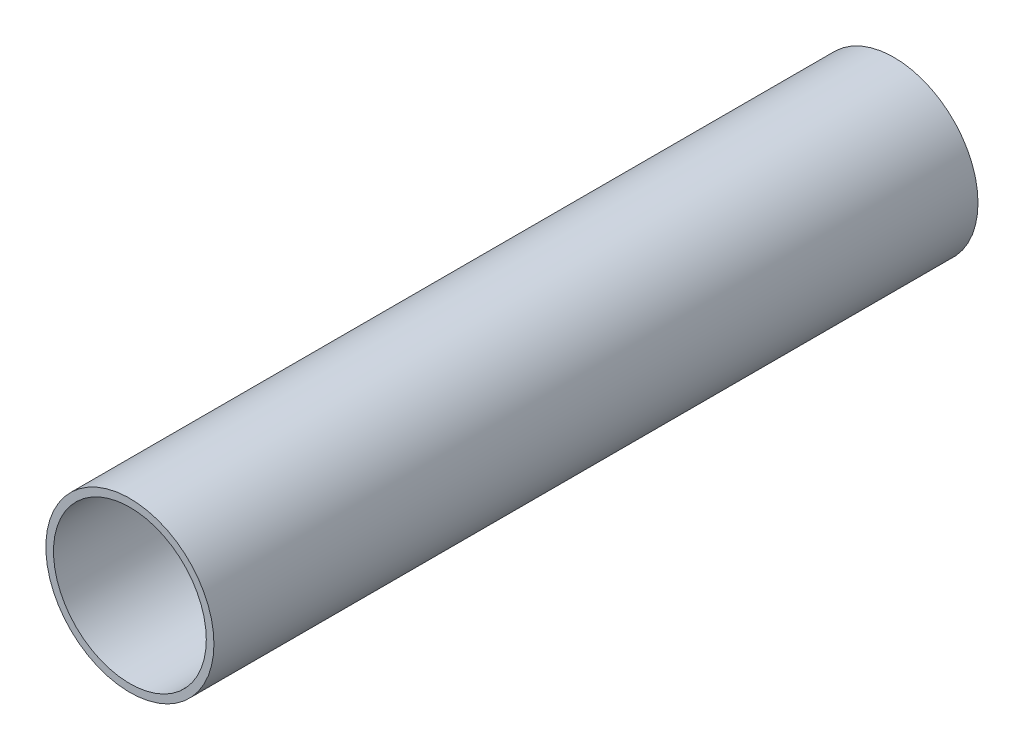
ISO-10303-21;
HEADER;
FILE_DESCRIPTION(('STEP AP214'),'2;1');
FILE_NAME('part.step','',(''),(''),'','','');
FILE_SCHEMA(('AUTOMOTIVE_DESIGN { 1 0 10303 214 1 1 1 1 }'));
ENDSEC;
DATA;
#1=APPLICATION_CONTEXT('core data for automotive mechanical design processes');
#2=APPLICATION_PROTOCOL_DEFINITION('international standard','automotive_design',2000,#1);
#3=PRODUCT_CONTEXT('',#1,'mechanical');
#4=PRODUCT('Part','Part','',(#3));
#5=PRODUCT_RELATED_PRODUCT_CATEGORY('part','',(#4));
#6=PRODUCT_DEFINITION_FORMATION('','',#4);
#7=PRODUCT_DEFINITION_CONTEXT('part definition',#1,'design');
#8=PRODUCT_DEFINITION('design','',#6,#7);
#9=PRODUCT_DEFINITION_SHAPE('','',#8);
#10=(LENGTH_UNIT() NAMED_UNIT(*) SI_UNIT(.MILLI.,.METRE.));
#11=(NAMED_UNIT(*) PLANE_ANGLE_UNIT() SI_UNIT($,.RADIAN.));
#12=(NAMED_UNIT(*) SI_UNIT($,.STERADIAN.) SOLID_ANGLE_UNIT());
#13=UNCERTAINTY_MEASURE_WITH_UNIT(LENGTH_MEASURE(1.E-05),#10,'distance_accuracy_value','');
#14=(GEOMETRIC_REPRESENTATION_CONTEXT(3) GLOBAL_UNCERTAINTY_ASSIGNED_CONTEXT((#13)) GLOBAL_UNIT_ASSIGNED_CONTEXT((#10,
#11,#12)) REPRESENTATION_CONTEXT('',''));
#15=CARTESIAN_POINT('',(0.,0.,0.));
#16=DIRECTION('',(0.,0.,1.));
#17=DIRECTION('',(1.,0.,0.));
#18=AXIS2_PLACEMENT_3D('',#15,#16,#17);
#19=CARTESIAN_POINT('',(5.97510893053155,-5.9503027345329,0.));
#20=CARTESIAN_POINT('',(4.83520314815448,-5.9503027345329,0.));
#21=CARTESIAN_POINT('',(2.20454484509527,-4.1934488322254,0.));
#22=CARTESIAN_POINT('',(1.11300132203786,-1.95627127428695,0.));
#23=CARTESIAN_POINT('',(0.,-1.92225121142364,0.));
#24=B_SPLINE_CURVE_WITH_KNOTS('',3,(#19,#20,#21,#22,#23),.UNSPECIFIED.,.F.,.F.,(4,1,4),(0.,
0.598579126831462,1.),.UNSPECIFIED.);
#25=CARTESIAN_POINT('',(0.,2.86154266494521,0.));
#26=DIRECTION('',(0.,1.,0.));
#27=AXIS1_PLACEMENT('',#25,#26);
#28=SURFACE_OF_REVOLUTION('',#24,#27);
#29=CARTESIAN_POINT('',(0.,-1.92225121142364,0.));
#30=VERTEX_POINT('',#29);
#31=VERTEX_LOOP('',#30);
#32=FACE_BOUND('',#31,.T.);
#33=CARTESIAN_POINT('',(3.09358975745318,-4.54749408054379,0.));
#34=CARTESIAN_POINT('',(3.09358974214245,-4.54749417519295,0.157753409518567));
#35=CARTESIAN_POINT('',(3.08678868085522,-4.55214299868664,0.315507336138191));
#36=CARTESIAN_POINT('',(3.05974311164556,-4.57036471173576,0.629272130302329));
#37=CARTESIAN_POINT('',(3.03950317532594,-4.58393456654162,0.785283572256019));
#38=CARTESIAN_POINT('',(2.98869249874833,-4.61719959985046,1.07854973319765));
#39=CARTESIAN_POINT('',(2.95936818091502,-4.63613981983031,1.21611045859594));
#40=CARTESIAN_POINT('',(2.89053728738395,-4.67936370981317,1.48785586234611));
#41=CARTESIAN_POINT('',(2.85102623355709,-4.7036497291622,1.62203902736154));
#42=CARTESIAN_POINT('',(2.76197452256602,-4.75648888192665,1.88683121421016));
#43=CARTESIAN_POINT('',(2.71239086679184,-4.78506016692956,2.0174220919051));
#44=CARTESIAN_POINT('',(2.60354724428159,-4.84514242696203,2.27377480080749));
#45=CARTESIAN_POINT('',(2.54428878273918,-4.87665294438327,2.39953737944209));
#46=CARTESIAN_POINT('',(2.41385122371559,-4.94255550405302,2.65004843840772));
#47=CARTESIAN_POINT('',(2.3423196083148,-4.97701045748037,2.77459719390312));
#48=CARTESIAN_POINT('',(2.1887404506506,-5.04643679124315,3.01700844417564));
#49=CARTESIAN_POINT('',(2.10668729329166,-5.08140843844374,3.1348673199164));
#50=CARTESIAN_POINT('',(1.93210193819943,-5.15031583864049,3.36192674020767));
#51=CARTESIAN_POINT('',(1.83962459146196,-5.18425592132687,3.47116789745703));
#52=CARTESIAN_POINT('',(1.64323777427266,-5.24980703389604,3.67947732649484));
#53=CARTESIAN_POINT('',(1.53934472919712,-5.28142130360681,3.7785598279674));
#54=CARTESIAN_POINT('',(1.33652425429816,-5.33600302572128,3.94873750695461));
#55=CARTESIAN_POINT('',(1.23939964138878,-5.35954775428829,4.02178192133363));
#56=CARTESIAN_POINT('',(1.03573759023012,-5.40259657531082,4.1552757162151));
#57=CARTESIAN_POINT('',(0.929199223146883,-5.42210026840999,4.21572385189051));
#58=CARTESIAN_POINT('',(0.761878574915611,-5.44727396767872,4.2938814493846));
#59=CARTESIAN_POINT('',(0.704369398163561,-5.45502936899757,4.31798715597345));
#60=CARTESIAN_POINT('',(0.587279934826621,-5.46887295607361,4.36106120374947));
#61=CARTESIAN_POINT('',(0.527701053774777,-5.47496224926969,4.38003295731137));
#62=CARTESIAN_POINT('',(0.406966848548687,-5.48525654124669,4.41213693242173));
#63=CARTESIAN_POINT('',(0.345815507706721,-5.48946588413098,4.42528261604213));
#64=CARTESIAN_POINT('',(0.222380538355597,-5.49584946207137,4.44522981153779));
#65=CARTESIAN_POINT('',(0.160097211414771,-5.49802423127862,4.452032988555));
#66=CARTESIAN_POINT('',(0.0442526240373497,-5.50008120850129,4.45846797470255));
#67=CARTESIAN_POINT('',(-0.00925499735311356,-5.50025167308739,4.45900147427106));
#68=CARTESIAN_POINT('',(-0.116073528785587,-5.49903433832133,4.45519287495855));
#69=CARTESIAN_POINT('',(-0.169384460418759,-5.49764671543927,4.4508513282287));
#70=CARTESIAN_POINT('',(-0.275389009569962,-5.49335763193931,4.43744237722512));
#71=CARTESIAN_POINT('',(-0.328082040247011,-5.49045483528806,4.42837080216631));
#72=CARTESIAN_POINT('',(-0.432430842837643,-5.48322368002583,4.40579637921201));
#73=CARTESIAN_POINT('',(-0.484086007294507,-5.47889451095515,4.39229101206741));
#74=CARTESIAN_POINT('',(-0.595155652214573,-5.46803752632223,4.3584613562716));
#75=CARTESIAN_POINT('',(-0.654305340516107,-5.46125494708567,4.33734946038497));
#76=CARTESIAN_POINT('',(-0.770413743320283,-5.44609008002036,4.29020465691083));
#77=CARTESIAN_POINT('',(-0.827370826720823,-5.43770662789985,4.26416816786949));
#78=CARTESIAN_POINT('',(-0.994802910295126,-5.41046754950585,4.17965133664999));
#79=CARTESIAN_POINT('',(-1.10175609922782,-5.38953181931067,4.11479050440023));
#80=CARTESIAN_POINT('',(-1.28452897462816,-5.34853660964552,3.9875976343325));
#81=CARTESIAN_POINT('',(-1.36218309016507,-5.32920886484022,3.92757144273162));
#82=CARTESIAN_POINT('',(-1.51179191772786,-5.28871313747419,3.80127555147091));
#83=CARTESIAN_POINT('',(-1.58374335097954,-5.26754411072318,3.735002307303));
#84=CARTESIAN_POINT('',(-1.72229362087285,-5.22388665754867,3.59726861765878));
#85=CARTESIAN_POINT('',(-1.78888245873965,-5.20139589579686,3.52579893451264));
#86=CARTESIAN_POINT('',(-1.91685208450686,-5.15560808682439,3.37856981753582));
#87=CARTESIAN_POINT('',(-1.97823136357064,-5.13231080874562,3.30280915143562));
#88=CARTESIAN_POINT('',(-2.12435975086516,-5.07404423034938,3.11019420565241));
#89=CARTESIAN_POINT('',(-2.2061194887518,-5.03885964866355,2.99112824831183));
#90=CARTESIAN_POINT('',(-2.35908109438386,-4.96908437753345,2.74620294725188));
#91=CARTESIAN_POINT('',(-2.43027832045776,-4.93449395506028,2.62034064983979));
#92=CARTESIAN_POINT('',(-2.56224422425789,-4.86727724406165,2.36270657750113));
#93=CARTESIAN_POINT('',(-2.62300960077134,-4.83465157940668,2.23093294848141));
#94=CARTESIAN_POINT('',(-2.73397060586604,-4.77278111958529,1.96226017034643));
#95=CARTESIAN_POINT('',(-2.78416781848666,-4.74353581804031,1.82536179299688));
#96=CARTESIAN_POINT('',(-2.87417295709771,-4.68955381474192,1.54570413848615));
#97=CARTESIAN_POINT('',(-2.91386907770294,-4.66486641722053,1.40289915892754));
#98=CARTESIAN_POINT('',(-2.98176964179674,-4.62176074709849,1.11363603416345));
#99=CARTESIAN_POINT('',(-3.00997415694914,-4.60334243540276,0.967177911745718));
#100=CARTESIAN_POINT('',(-3.05441418293933,-4.57397711032861,0.672042143291859));
#101=CARTESIAN_POINT('',(-3.07067658709127,-4.56301331373705,0.523370258368008));
#102=CARTESIAN_POINT('',(-3.09102710249251,-4.54925356339956,0.224825354031251));
#103=CARTESIAN_POINT('',(-3.09511693869607,-4.54645645236733,0.0749525078230144));
#104=CARTESIAN_POINT('',(-3.09124883572044,-4.5490853335647,-0.209568066986037));
#105=CARTESIAN_POINT('',(-3.08445368440705,-4.55371773133345,-0.34424101076818));
#106=CARTESIAN_POINT('',(-3.06105470582761,-4.56947943992185,-0.612337406307052));
#107=CARTESIAN_POINT('',(-3.04445118709779,-4.58060854637811,-0.745760897233002));
#108=CARTESIAN_POINT('',(-3.00164491778471,-4.60877238408859,-1.01062888448159));
#109=CARTESIAN_POINT('',(-2.97542790964833,-4.62581588482546,-1.14207013798931));
#110=CARTESIAN_POINT('',(-2.91372285661253,-4.66492699460305,-1.40194538555005));
#111=CARTESIAN_POINT('',(-2.87823452223849,-4.68699476051148,-1.53037928556933));
#112=CARTESIAN_POINT('',(-2.7586050717714,-4.75907498255935,-1.90934122506292));
#113=CARTESIAN_POINT('',(-2.66110420580567,-4.81510629910776,-2.15471534091251));
#114=CARTESIAN_POINT('',(-2.48936300845282,-4.9048164063901,-2.50850000567307));
#115=CARTESIAN_POINT('',(-2.427844808314,-4.93567398104013,-2.62408211961013));
#116=CARTESIAN_POINT('',(-2.29618666382307,-4.99828427572361,-2.8500084124693));
#117=CARTESIAN_POINT('',(-2.22604893791878,-5.03003676381435,-2.9603539290666));
#118=CARTESIAN_POINT('',(-2.09628846445495,-5.0851914573401,-3.14710272454613));
#119=CARTESIAN_POINT('',(-2.03865542787935,-5.10862383013312,-3.22488759293326));
#120=CARTESIAN_POINT('',(-1.91838499282661,-5.15499303285264,-3.37663480845507));
#121=CARTESIAN_POINT('',(-1.85574869054999,-5.17792996993614,-3.45059798709395));
#122=CARTESIAN_POINT('',(-1.7253127295189,-5.22283918957591,-3.59399614178446));
#123=CARTESIAN_POINT('',(-1.65751913714236,-5.24481255899709,-3.66343626495394));
#124=CARTESIAN_POINT('',(-1.51646616664896,-5.28732004996128,-3.79695737237444));
#125=CARTESIAN_POINT('',(-1.44320912181584,-5.30785477872178,-3.86104061987408));
#126=CARTESIAN_POINT('',(-1.26740763254331,-5.35296831575692,-4.00143124708381));
#127=CARTESIAN_POINT('',(-1.16279235680269,-5.37684456825547,-4.07542406807821));
#128=CARTESIAN_POINT('',(-0.943335038918813,-5.41964687610595,-4.20812712652198));
#129=CARTESIAN_POINT('',(-0.82851017986201,-5.43858104538773,-4.26686241307893));
#130=CARTESIAN_POINT('',(-0.615416541860231,-5.46627059398557,-4.35294065657472));
#131=CARTESIAN_POINT('',(-0.519000705481699,-5.47634542174041,-4.38433670669694));
#132=CARTESIAN_POINT('',(-0.371360639802908,-5.48767158637175,-4.41967859873461));
#133=CARTESIAN_POINT('',(-0.321652274648493,-5.49081577326381,-4.42949993788172));
#134=CARTESIAN_POINT('',(-0.221531795017059,-5.49576472618769,-4.44496604505012));
#135=CARTESIAN_POINT('',(-0.171119976482204,-5.49757003914569,-4.4506125184893));
#136=CARTESIAN_POINT('',(-0.0697220311419206,-5.49979306277102,-4.45756627687502));
#137=CARTESIAN_POINT('',(-0.018734307017999,-5.50020403783138,-4.4588524987961));
#138=CARTESIAN_POINT('',(0.0831501012403812,-5.49960735170899,-4.45698560591668));
#139=CARTESIAN_POINT('',(0.134046786936348,-5.49859971509674,-4.45383256800465));
#140=CARTESIAN_POINT('',(0.235363872889206,-5.49519561525442,-4.44318771422214));
#141=CARTESIAN_POINT('',(0.28578397967529,-5.49279834657532,-4.43569338208211));
#142=CARTESIAN_POINT('',(0.385775482515701,-5.48668287482104,-4.41659304331913));
#143=CARTESIAN_POINT('',(0.435346429710835,-5.48296399444225,-4.40498492846071));
#144=CARTESIAN_POINT('',(0.543140950374791,-5.47343407993973,-4.37527104486671));
#145=CARTESIAN_POINT('',(0.601110859723132,-5.46735329726099,-4.35632984598563));
#146=CARTESIAN_POINT('',(0.715062930894766,-5.45362131865959,-4.31360988813382));
#147=CARTESIAN_POINT('',(0.771043636380648,-5.44596899888072,-4.28982766730211));
#148=CARTESIAN_POINT('',(0.935825465107132,-5.42093877044797,-4.21212192250395));
#149=CARTESIAN_POINT('',(1.04136691582617,-5.40149697481268,-4.15186861585499));
#150=CARTESIAN_POINT('',(1.22110708415373,-5.36333971870363,-4.0335386680841));
#151=CARTESIAN_POINT('',(1.29711584558257,-5.34539351615346,-3.97786232991428));
#152=CARTESIAN_POINT('',(1.44382035194976,-5.3076468364449,-3.86039001286808));
#153=CARTESIAN_POINT('',(1.51451309306098,-5.28784532492321,-3.79859061917748));
#154=CARTESIAN_POINT('',(1.65088830820957,-5.24687033295824,-3.66991568412855));
#155=CARTESIAN_POINT('',(1.71656191148275,-5.22569454039957,-3.60303155392816));
#156=CARTESIAN_POINT('',(1.84303732135971,-5.18243945673001,-3.46506606981103));
#157=CARTESIAN_POINT('',(1.90383764342987,-5.16035989337709,-3.39398344828746));
#158=CARTESIAN_POINT('',(2.05119906038691,-5.10408118812751,-3.21028198286185));
#159=CARTESIAN_POINT('',(2.13469949586501,-5.06955476785541,-3.0952987515511));
#160=CARTESIAN_POINT('',(2.29139457952977,-5.00068312561168,-2.85843432437823));
#161=CARTESIAN_POINT('',(2.36458436751567,-4.9663379963897,-2.73654991315711));
#162=CARTESIAN_POINT('',(2.50089950861812,-4.89911012580841,-2.48674096672283));
#163=CARTESIAN_POINT('',(2.5640155838167,-4.86622875243776,-2.35881100245825));
#164=CARTESIAN_POINT('',(2.68006242220296,-4.80329273867129,-2.09776311482459));
#165=CARTESIAN_POINT('',(2.73299445075126,-4.77323774733703,-1.96464583845017));
#166=CARTESIAN_POINT('',(2.83189399404045,-4.71528336750483,-1.68413220281671));
#167=CARTESIAN_POINT('',(2.87708794046224,-4.68769397586848,-1.53639706929189));
#168=CARTESIAN_POINT('',(2.95507791458369,-4.63892606832185,-1.23666230448725));
#169=CARTESIAN_POINT('',(2.98787600698181,-4.61774648488785,-1.08466338793332));
#170=CARTESIAN_POINT('',(3.04051046845504,-4.58326196363492,-0.777992958960109));
#171=CARTESIAN_POINT('',(3.06038409290701,-4.56993440253962,-0.623330459300931));
#172=CARTESIAN_POINT('',(3.086920086104,-4.55205284396441,-0.312444867018572));
#173=CARTESIAN_POINT('',(3.09358977261534,-4.54749398681303,-0.156222687066591));
#174=CARTESIAN_POINT('',(3.09358975745318,-4.54749408054379,0.));
#175=B_SPLINE_CURVE_WITH_KNOTS('',3,(#33,#34,#35,#36,#37,#38,#39,#40,#41,#42,#43,#44,#45,#46,
#47,#48,#49,#50,#51,#52,#53,#54,#55,#56,#57,#58,#59,#60,#61,#62,#63,#64,#65,#66,#67,#68,#69,#70,
#71,#72,#73,#74,#75,#76,#77,#78,#79,#80,#81,#82,#83,#84,#85,#86,#87,#88,#89,#90,#91,#92,#93,#94,
#95,#96,#97,#98,#99,#100,#101,#102,#103,#104,#105,#106,#107,#108,#109,#110,#111,#112,#113,#114,
#115,#116,#117,#118,#119,#120,#121,#122,#123,#124,#125,#126,#127,#128,#129,#130,#131,#132,#133,
#134,#135,#136,#137,#138,#139,#140,#141,#142,#143,#144,#145,#146,#147,#148,#149,#150,#151,#152,
#153,#154,#155,#156,#157,#158,#159,#160,#161,#162,#163,#164,#165,#166,#167,#168,#169,#170,#171,
#172,#173,#174),.UNSPECIFIED.,.T.,.F.,(4,2,2,2,2,2,2,2,2,2,2,2,2,2,2,2,2,2,2,2,2,2,2,2,2,2,2,2,
2,2,2,2,2,2,2,2,2,2,2,2,2,2,2,2,2,2,2,2,2,2,2,2,2,2,2,2,2,2,2,2,2,2,2,2,2,2,2,2,2,2,4),(0.,
0.473053685539632,0.945946531251939,1.37119059223383,1.79662191187025,2.22390901821821,
2.65112971103256,3.09374006211533,3.53658761458955,3.97720508181543,4.41719667295682,
4.78776760353811,5.15837513843599,5.34666889107996,5.5348371817521,5.722568383106,
5.9102502842036,6.07054194790647,6.23081545869385,6.39123053304244,6.55173691230182,
6.74095338279174,6.93030799545973,7.30927599507865,7.60902152152207,7.90893815586495,
8.20940163827177,8.50995184859801,8.95531476026484,9.40087280957012,9.846571599151,
10.2922035362622,10.7424048146024,11.1926032853595,11.6417847857785,12.0909026304063,
12.4951523342067,12.8993893224318,13.304228266472,13.709079852135,14.5151904640764,
14.9184936302741,15.3216932129782,15.6203364337357,15.9189144011913,16.2171464343566,
16.5152518225998,16.9051780267563,17.2944599635666,17.5988176932783,17.7509507691606,
17.9030216648325,18.0558261290885,18.2086279467868,18.3615184191125,18.5144873584772,
18.6980685743867,18.8817815351085,19.2495156915376,19.5369109590905,19.8244674182984,
20.1125208809756,20.4006617616615,20.8387577288839,21.2770595183302,21.7157626841408,
22.1544113061413,22.6245741374235,23.0946586221281,23.5633819888545,24.0318455111789),.UNSPECIFIED.);
#176=CARTESIAN_POINT('',(3.09358975745318,-4.54749408054379,0.));
#177=VERTEX_POINT('',#176);
#178=EDGE_CURVE('E12',#177,#177,#175,.T.);
#179=ORIENTED_EDGE('',*,*,#178,.F.);
#180=EDGE_LOOP('',(#179));
#181=FACE_BOUND('',#180,.T.);
#182=ADVANCED_FACE('F43',(#32,#181),#28,.T.);
#183=CARTESIAN_POINT('',(0.,0.,-25.));
#184=DIRECTION('',(0.,0.,1.));
#185=DIRECTION('',(1.,0.,0.));
#186=AXIS2_PLACEMENT_3D('',#183,#184,#185);
#187=CYLINDRICAL_SURFACE('',#186,5.5);
#188=ORIENTED_EDGE('',*,*,#178,.T.);
#189=EDGE_LOOP('',(#188));
#190=FACE_BOUND('',#189,.T.);
#191=ADVANCED_FACE('F57',(#190),#187,.T.);
#192=CLOSED_SHELL('',(#182,#191));
#193=MANIFOLD_SOLID_BREP('B2',#192);
#194=CARTESIAN_POINT('',(0.,0.,-25.));
#195=DIRECTION('',(0.,0.,1.));
#196=DIRECTION('',(1.,0.,0.));
#197=AXIS2_PLACEMENT_3D('',#194,#195,#196);
#198=CYLINDRICAL_SURFACE('',#197,5.5);
#199=CARTESIAN_POINT('',(0.,0.,-25.));
#200=DIRECTION('',(0.,0.,1.));
#201=DIRECTION('',(1.,0.,0.));
#202=AXIS2_PLACEMENT_3D('',#199,#200,#201);
#203=CIRCLE('',#202,5.5);
#204=CARTESIAN_POINT('',(5.5,0.,-25.));
#205=VERTEX_POINT('',#204);
#206=EDGE_CURVE('E42',#205,#205,#203,.T.);
#207=ORIENTED_EDGE('',*,*,#206,.T.);
#208=EDGE_LOOP('',(#207));
#209=FACE_BOUND('',#208,.T.);
#210=CARTESIAN_POINT('',(0.,0.,25.));
#211=DIRECTION('',(0.,0.,1.));
#212=DIRECTION('',(1.,0.,0.));
#213=AXIS2_PLACEMENT_3D('',#210,#211,#212);
#214=CIRCLE('',#213,5.5);
#215=CARTESIAN_POINT('',(5.5,0.,25.));
#216=VERTEX_POINT('',#215);
#217=EDGE_CURVE('E95',#216,#216,#214,.T.);
#218=ORIENTED_EDGE('',*,*,#217,.F.);
#219=EDGE_LOOP('',(#218));
#220=FACE_BOUND('',#219,.T.);
#221=ADVANCED_FACE('F85',(#209,#220),#198,.T.);
#222=CARTESIAN_POINT('',(0.,0.,-25.));
#223=DIRECTION('',(0.,0.,1.));
#224=DIRECTION('',(1.,0.,0.));
#225=AXIS2_PLACEMENT_3D('',#222,#223,#224);
#226=PLANE('',#225);
#227=CARTESIAN_POINT('',(0.,0.,-25.));
#228=DIRECTION('',(0.,0.,1.));
#229=DIRECTION('',(1.,0.,0.));
#230=AXIS2_PLACEMENT_3D('',#227,#228,#229);
#231=CIRCLE('',#230,5.);
#232=CARTESIAN_POINT('',(5.,0.,-25.));
#233=VERTEX_POINT('',#232);
#234=EDGE_CURVE('E91',#233,#233,#231,.T.);
#235=ORIENTED_EDGE('',*,*,#234,.T.);
#236=EDGE_LOOP('',(#235));
#237=FACE_BOUND('',#236,.T.);
#238=ORIENTED_EDGE('',*,*,#206,.F.);
#239=EDGE_LOOP('',(#238));
#240=FACE_BOUND('',#239,.T.);
#241=ADVANCED_FACE('F114',(#237,#240),#226,.F.);
#242=CARTESIAN_POINT('',(0.,0.,-25.));
#243=DIRECTION('',(0.,0.,1.));
#244=DIRECTION('',(1.,0.,0.));
#245=AXIS2_PLACEMENT_3D('',#242,#243,#244);
#246=CYLINDRICAL_SURFACE('',#245,5.);
#247=ORIENTED_EDGE('',*,*,#234,.F.);
#248=EDGE_LOOP('',(#247));
#249=FACE_BOUND('',#248,.T.);
#250=CARTESIAN_POINT('',(0.,0.,25.));
#251=DIRECTION('',(0.,0.,1.));
#252=DIRECTION('',(1.,0.,0.));
#253=AXIS2_PLACEMENT_3D('',#250,#251,#252);
#254=CIRCLE('',#253,5.);
#255=CARTESIAN_POINT('',(5.,0.,25.));
#256=VERTEX_POINT('',#255);
#257=EDGE_CURVE('E99',#256,#256,#254,.T.);
#258=ORIENTED_EDGE('',*,*,#257,.T.);
#259=EDGE_LOOP('',(#258));
#260=FACE_BOUND('',#259,.T.);
#261=ADVANCED_FACE('F105',(#249,#260),#246,.F.);
#262=CARTESIAN_POINT('',(0.,0.,25.));
#263=DIRECTION('',(0.,0.,1.));
#264=DIRECTION('',(1.,0.,0.));
#265=AXIS2_PLACEMENT_3D('',#262,#263,#264);
#266=PLANE('',#265);
#267=ORIENTED_EDGE('',*,*,#217,.T.);
#268=EDGE_LOOP('',(#267));
#269=FACE_BOUND('',#268,.T.);
#270=ORIENTED_EDGE('',*,*,#257,.F.);
#271=EDGE_LOOP('',(#270));
#272=FACE_BOUND('',#271,.T.);
#273=ADVANCED_FACE('F107',(#269,#272),#266,.T.);
#274=CLOSED_SHELL('',(#221,#241,#261,#273));
#275=MANIFOLD_SOLID_BREP('B6',#274);
#276=ADVANCED_BREP_SHAPE_REPRESENTATION('',(#18,#193,#275),#14);
#277=SHAPE_DEFINITION_REPRESENTATION(#9,#276);
ENDSEC;
END-ISO-10303-21;
